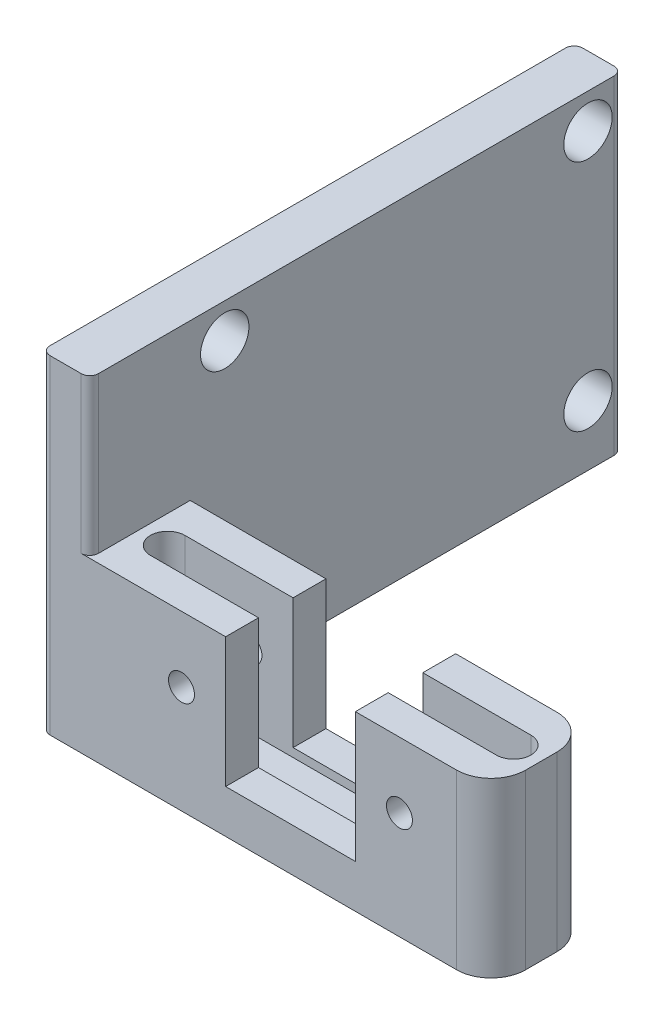
ISO-10303-21;
HEADER;
FILE_DESCRIPTION(('STEP AP214'),'2;1');
FILE_NAME('part.step','',(''),(''),'','','');
FILE_SCHEMA(('AUTOMOTIVE_DESIGN { 1 0 10303 214 1 1 1 1 }'));
ENDSEC;
DATA;
#1=APPLICATION_CONTEXT('core data for automotive mechanical design processes');
#2=APPLICATION_PROTOCOL_DEFINITION('international standard','automotive_design',2000,#1);
#3=PRODUCT_CONTEXT('',#1,'mechanical');
#4=PRODUCT('Part','Part','',(#3));
#5=PRODUCT_RELATED_PRODUCT_CATEGORY('part','',(#4));
#6=PRODUCT_DEFINITION_FORMATION('','',#4);
#7=PRODUCT_DEFINITION_CONTEXT('part definition',#1,'design');
#8=PRODUCT_DEFINITION('design','',#6,#7);
#9=PRODUCT_DEFINITION_SHAPE('','',#8);
#10=(LENGTH_UNIT() NAMED_UNIT(*) SI_UNIT(.MILLI.,.METRE.));
#11=(NAMED_UNIT(*) PLANE_ANGLE_UNIT() SI_UNIT($,.RADIAN.));
#12=(NAMED_UNIT(*) SI_UNIT($,.STERADIAN.) SOLID_ANGLE_UNIT());
#13=UNCERTAINTY_MEASURE_WITH_UNIT(LENGTH_MEASURE(1.E-05),#10,'distance_accuracy_value','');
#14=(GEOMETRIC_REPRESENTATION_CONTEXT(3) GLOBAL_UNCERTAINTY_ASSIGNED_CONTEXT((#13)) GLOBAL_UNIT_ASSIGNED_CONTEXT((#10,
#11,#12)) REPRESENTATION_CONTEXT('',''));
#15=CARTESIAN_POINT('',(0.,0.,0.));
#16=DIRECTION('',(0.,0.,1.));
#17=DIRECTION('',(1.,0.,0.));
#18=AXIS2_PLACEMENT_3D('',#15,#16,#17);
#19=CARTESIAN_POINT('',(20.78,10.,-18.4025));
#20=DIRECTION('',(0.,-1.,0.));
#21=DIRECTION('',(1.,0.,0.));
#22=AXIS2_PLACEMENT_3D('',#19,#20,#21);
#23=PLANE('',#22);
#24=DIRECTION('',(1.,0.,0.));
#25=VECTOR('',#24,1.);
#26=CARTESIAN_POINT('',(20.78,10.,12.3975));
#27=LINE('',#26,#25);
#28=CARTESIAN_POINT('',(-2.92,9.99999999999999,12.3975));
#29=VERTEX_POINT('',#28);
#30=CARTESIAN_POINT('',(5.42999999999999,9.99999999999999,12.3975));
#31=VERTEX_POINT('',#30);
#32=EDGE_CURVE('E48',#29,#31,#27,.T.);
#33=ORIENTED_EDGE('',*,*,#32,.T.);
#34=DIRECTION('',(0.,0.,1.));
#35=VECTOR('',#34,1.);
#36=CARTESIAN_POINT('',(5.42999999999999,9.99999999999999,-18.4025));
#37=LINE('',#36,#35);
#38=CARTESIAN_POINT('',(5.42999999999999,9.99999999999999,10.4975));
#39=VERTEX_POINT('',#38);
#40=EDGE_CURVE('E216',#39,#31,#37,.T.);
#41=ORIENTED_EDGE('',*,*,#40,.F.);
#42=DIRECTION('',(1.,0.,0.));
#43=VECTOR('',#42,1.);
#44=CARTESIAN_POINT('',(-0.820000000000008,9.99999999999999,10.4975));
#45=LINE('',#44,#43);
#46=CARTESIAN_POINT('',(-0.820000000000008,9.99999999999999,10.4975));
#47=VERTEX_POINT('',#46);
#48=EDGE_CURVE('E269',#47,#39,#45,.T.);
#49=ORIENTED_EDGE('',*,*,#48,.F.);
#50=CARTESIAN_POINT('',(-0.820000000000008,9.99999999999999,9.49749999999998));
#51=DIRECTION('',(0.,1.,0.));
#52=DIRECTION('',(-1.,0.,0.));
#53=AXIS2_PLACEMENT_3D('',#50,#51,#52);
#54=CIRCLE('',#53,1.);
#55=CARTESIAN_POINT('',(-0.820000000000008,9.99999999999999,8.49749999999998));
#56=VERTEX_POINT('',#55);
#57=EDGE_CURVE('E252',#56,#47,#54,.T.);
#58=ORIENTED_EDGE('',*,*,#57,.F.);
#59=DIRECTION('',(-1.,0.,0.));
#60=VECTOR('',#59,1.);
#61=CARTESIAN_POINT('',(-0.820000000000008,9.99999999999999,8.49749999999998));
#62=LINE('',#61,#60);
#63=CARTESIAN_POINT('',(5.42999999999999,9.99999999999999,8.49749999999997));
#64=VERTEX_POINT('',#63);
#65=EDGE_CURVE('E275',#64,#56,#62,.T.);
#66=ORIENTED_EDGE('',*,*,#65,.F.);
#67=CARTESIAN_POINT('',(5.42999999999999,9.99999999999999,6.59749999999998));
#68=VERTEX_POINT('',#67);
#69=EDGE_CURVE('E226',#68,#64,#37,.T.);
#70=ORIENTED_EDGE('',*,*,#69,.F.);
#71=DIRECTION('',(1.,0.,0.));
#72=VECTOR('',#71,1.);
#73=CARTESIAN_POINT('',(-2.42,9.99999999999999,6.59749999999999));
#74=LINE('',#73,#72);
#75=CARTESIAN_POINT('',(-2.42000000000001,9.99999999999999,6.59749999999998));
#76=VERTEX_POINT('',#75);
#77=EDGE_CURVE('E297',#76,#68,#74,.T.);
#78=ORIENTED_EDGE('',*,*,#77,.F.);
#79=DIRECTION('',(0.,0.,1.));
#80=VECTOR('',#79,1.);
#81=CARTESIAN_POINT('',(-2.42000000000001,9.99999999999999,-18.4025));
#82=LINE('',#81,#80);
#83=CARTESIAN_POINT('',(-2.42000000000001,9.99999999999999,11.8975));
#84=VERTEX_POINT('',#83);
#85=EDGE_CURVE('E290',#76,#84,#82,.T.);
#86=ORIENTED_EDGE('',*,*,#85,.T.);
#87=CARTESIAN_POINT('',(-2.92,9.99999999999999,11.8975));
#88=DIRECTION('',(0.,-1.,0.));
#89=DIRECTION('',(1.,0.,0.));
#90=AXIS2_PLACEMENT_3D('',#87,#88,#89);
#91=CIRCLE('',#90,0.5);
#92=EDGE_CURVE('E11',#84,#29,#91,.T.);
#93=ORIENTED_EDGE('',*,*,#92,.T.);
#94=EDGE_LOOP('',(#33,#41,#49,#58,#66,#70,#78,#86,#93));
#95=FACE_BOUND('',#94,.T.);
#96=ADVANCED_FACE('F33',(#95),#23,.F.);
#97=CARTESIAN_POINT('',(-5.22000000000001,19.,12.3975));
#98=DIRECTION('',(1.,0.,0.));
#99=DIRECTION('',(0.,0.,-1.));
#100=AXIS2_PLACEMENT_3D('',#97,#98,#99);
#101=PLANE('',#100);
#102=CARTESIAN_POINT('',(-5.22000000000001,3.5,4.59749999999999));
#103=DIRECTION('',(-1.,0.,0.));
#104=DIRECTION('',(0.,0.,1.));
#105=AXIS2_PLACEMENT_3D('',#102,#103,#104);
#106=CIRCLE('',#105,1.4);
#107=CARTESIAN_POINT('',(-5.22000000000001,3.5,5.99749999999999));
#108=VERTEX_POINT('',#107);
#109=EDGE_CURVE('E351',#108,#108,#106,.T.);
#110=ORIENTED_EDGE('',*,*,#109,.F.);
#111=EDGE_LOOP('',(#110));
#112=FACE_BOUND('',#111,.T.);
#113=CARTESIAN_POINT('',(-5.22000000000001,3.5,-16.4025));
#114=DIRECTION('',(-1.,0.,0.));
#115=DIRECTION('',(0.,0.,1.));
#116=AXIS2_PLACEMENT_3D('',#113,#114,#115);
#117=CIRCLE('',#116,1.4);
#118=CARTESIAN_POINT('',(-5.22000000000001,3.5,-15.0025));
#119=VERTEX_POINT('',#118);
#120=EDGE_CURVE('E347',#119,#119,#117,.T.);
#121=ORIENTED_EDGE('',*,*,#120,.F.);
#122=EDGE_LOOP('',(#121));
#123=FACE_BOUND('',#122,.T.);
#124=CARTESIAN_POINT('',(-5.22000000000001,17.,4.59749999999999));
#125=DIRECTION('',(-1.,0.,0.));
#126=DIRECTION('',(0.,0.,1.));
#127=AXIS2_PLACEMENT_3D('',#124,#125,#126);
#128=CIRCLE('',#127,1.4);
#129=CARTESIAN_POINT('',(-5.22000000000001,17.,5.99749999999999));
#130=VERTEX_POINT('',#129);
#131=EDGE_CURVE('E343',#130,#130,#128,.T.);
#132=ORIENTED_EDGE('',*,*,#131,.F.);
#133=EDGE_LOOP('',(#132));
#134=FACE_BOUND('',#133,.T.);
#135=CARTESIAN_POINT('',(-5.22000000000001,17.,-16.4025));
#136=DIRECTION('',(-1.,0.,0.));
#137=DIRECTION('',(0.,0.,1.));
#138=AXIS2_PLACEMENT_3D('',#135,#136,#137);
#139=CIRCLE('',#138,1.4);
#140=CARTESIAN_POINT('',(-5.22000000000001,17.,-15.0025));
#141=VERTEX_POINT('',#140);
#142=EDGE_CURVE('E339',#141,#141,#139,.T.);
#143=ORIENTED_EDGE('',*,*,#142,.F.);
#144=EDGE_LOOP('',(#143));
#145=FACE_BOUND('',#144,.T.);
#146=DIRECTION('',(0.,0.,1.));
#147=VECTOR('',#146,1.);
#148=CARTESIAN_POINT('',(-5.22000000000001,19.,12.3975));
#149=LINE('',#148,#147);
#150=CARTESIAN_POINT('',(-5.22000000000001,19.,-17.9025));
#151=VERTEX_POINT('',#150);
#152=CARTESIAN_POINT('',(-5.22000000000001,19.,11.8975));
#153=VERTEX_POINT('',#152);
#154=EDGE_CURVE('E301',#151,#153,#149,.T.);
#155=ORIENTED_EDGE('',*,*,#154,.F.);
#156=DIRECTION('',(0.,-1.,0.));
#157=VECTOR('',#156,1.);
#158=CARTESIAN_POINT('',(-5.22000000000001,19.,-17.9025));
#159=LINE('',#158,#157);
#160=CARTESIAN_POINT('',(-5.22000000000001,0.,-17.9025));
#161=VERTEX_POINT('',#160);
#162=EDGE_CURVE('E383',#151,#161,#159,.T.);
#163=ORIENTED_EDGE('',*,*,#162,.T.);
#164=DIRECTION('',(0.,0.,1.));
#165=VECTOR('',#164,1.);
#166=CARTESIAN_POINT('',(-5.22000000000001,0.,12.3975));
#167=LINE('',#166,#165);
#168=CARTESIAN_POINT('',(-5.22000000000001,0.,11.8975));
#169=VERTEX_POINT('',#168);
#170=EDGE_CURVE('E300',#161,#169,#167,.T.);
#171=ORIENTED_EDGE('',*,*,#170,.T.);
#172=DIRECTION('',(0.,-1.,0.));
#173=VECTOR('',#172,1.);
#174=CARTESIAN_POINT('',(-5.22000000000001,19.,11.8975));
#175=LINE('',#174,#173);
#176=EDGE_CURVE('E381',#169,#153,#175,.F.);
#177=ORIENTED_EDGE('',*,*,#176,.T.);
#178=EDGE_LOOP('',(#155,#163,#171,#177));
#179=FACE_BOUND('',#178,.T.);
#180=ADVANCED_FACE('F448',(#112,#123,#134,#145,#179),#101,.F.);
#181=CARTESIAN_POINT('',(20.78,19.,12.3975));
#182=DIRECTION('',(0.,0.,-1.));
#183=DIRECTION('',(-1.,0.,0.));
#184=AXIS2_PLACEMENT_3D('',#181,#182,#183);
#185=PLANE('',#184);
#186=CARTESIAN_POINT('',(15.48,6.2,12.3975));
#187=DIRECTION('',(0.,0.,1.));
#188=DIRECTION('',(1.,0.,0.));
#189=AXIS2_PLACEMENT_3D('',#186,#187,#188);
#190=CIRCLE('',#189,0.750000000000002);
#191=CARTESIAN_POINT('',(16.23,6.2,12.3975));
#192=VERTEX_POINT('',#191);
#193=EDGE_CURVE('E361',#192,#192,#190,.T.);
#194=ORIENTED_EDGE('',*,*,#193,.F.);
#195=EDGE_LOOP('',(#194));
#196=FACE_BOUND('',#195,.T.);
#197=CARTESIAN_POINT('',(2.87999999999999,6.2,12.3975));
#198=DIRECTION('',(0.,0.,1.));
#199=DIRECTION('',(1.,0.,0.));
#200=AXIS2_PLACEMENT_3D('',#197,#198,#199);
#201=CIRCLE('',#200,0.75);
#202=CARTESIAN_POINT('',(3.62999999999999,6.2,12.3975));
#203=VERTEX_POINT('',#202);
#204=EDGE_CURVE('E356',#203,#203,#201,.T.);
#205=ORIENTED_EDGE('',*,*,#204,.F.);
#206=EDGE_LOOP('',(#205));
#207=FACE_BOUND('',#206,.T.);
#208=ORIENTED_EDGE('',*,*,#32,.F.);
#209=DIRECTION('',(0.,-1.,0.));
#210=VECTOR('',#209,1.);
#211=CARTESIAN_POINT('',(-2.92,19.,12.3975));
#212=LINE('',#211,#210);
#213=CARTESIAN_POINT('',(-2.92,19.,12.3975));
#214=VERTEX_POINT('',#213);
#215=EDGE_CURVE('E52',#29,#214,#212,.F.);
#216=ORIENTED_EDGE('',*,*,#215,.T.);
#217=DIRECTION('',(1.,0.,0.));
#218=VECTOR('',#217,1.);
#219=CARTESIAN_POINT('',(20.78,19.,12.3975));
#220=LINE('',#219,#218);
#221=CARTESIAN_POINT('',(-4.72,19.,12.3975));
#222=VERTEX_POINT('',#221);
#223=EDGE_CURVE('E304',#222,#214,#220,.T.);
#224=ORIENTED_EDGE('',*,*,#223,.F.);
#225=DIRECTION('',(0.,-1.,0.));
#226=VECTOR('',#225,1.);
#227=CARTESIAN_POINT('',(-4.72000000000001,19.,12.3975));
#228=LINE('',#227,#226);
#229=CARTESIAN_POINT('',(-4.72,0.,12.3975));
#230=VERTEX_POINT('',#229);
#231=EDGE_CURVE('E386',#222,#230,#228,.T.);
#232=ORIENTED_EDGE('',*,*,#231,.T.);
#233=DIRECTION('',(1.,0.,0.));
#234=VECTOR('',#233,1.);
#235=CARTESIAN_POINT('',(20.78,0.,12.3975));
#236=LINE('',#235,#234);
#237=CARTESIAN_POINT('',(18.78,0.,12.3975));
#238=VERTEX_POINT('',#237);
#239=EDGE_CURVE('E315',#230,#238,#236,.T.);
#240=ORIENTED_EDGE('',*,*,#239,.T.);
#241=DIRECTION('',(0.,-1.,0.));
#242=VECTOR('',#241,1.);
#243=CARTESIAN_POINT('',(18.78,19.,12.3975));
#244=LINE('',#243,#242);
#245=CARTESIAN_POINT('',(18.78,10.,12.3975));
#246=VERTEX_POINT('',#245);
#247=EDGE_CURVE('E398',#238,#246,#244,.F.);
#248=ORIENTED_EDGE('',*,*,#247,.T.);
#249=CARTESIAN_POINT('',(12.93,9.99999999999999,12.3975));
#250=VERTEX_POINT('',#249);
#251=EDGE_CURVE('E281',#250,#246,#27,.T.);
#252=ORIENTED_EDGE('',*,*,#251,.F.);
#253=DIRECTION('',(0.,1.,0.));
#254=VECTOR('',#253,1.);
#255=CARTESIAN_POINT('',(12.93,2.5,12.3975));
#256=LINE('',#255,#254);
#257=CARTESIAN_POINT('',(12.93,2.5,12.3975));
#258=VERTEX_POINT('',#257);
#259=EDGE_CURVE('E211',#258,#250,#256,.T.);
#260=ORIENTED_EDGE('',*,*,#259,.F.);
#261=DIRECTION('',(1.,0.,0.));
#262=VECTOR('',#261,1.);
#263=CARTESIAN_POINT('',(12.93,2.5,12.3975));
#264=LINE('',#263,#262);
#265=CARTESIAN_POINT('',(5.42999999999999,2.5,12.3975));
#266=VERTEX_POINT('',#265);
#267=EDGE_CURVE('E204',#266,#258,#264,.T.);
#268=ORIENTED_EDGE('',*,*,#267,.F.);
#269=DIRECTION('',(0.,-1.,0.));
#270=VECTOR('',#269,1.);
#271=CARTESIAN_POINT('',(5.42999999999999,2.5,12.3975));
#272=LINE('',#271,#270);
#273=EDGE_CURVE('E213',#31,#266,#272,.T.);
#274=ORIENTED_EDGE('',*,*,#273,.F.);
#275=EDGE_LOOP('',(#208,#216,#224,#232,#240,#248,#252,#260,#268,#274));
#276=FACE_BOUND('',#275,.T.);
#277=ADVANCED_FACE('F219',(#196,#207,#276),#185,.F.);
#278=CARTESIAN_POINT('',(20.78,19.,6.59749999999999));
#279=DIRECTION('',(-1.,0.,0.));
#280=DIRECTION('',(0.,0.,1.));
#281=AXIS2_PLACEMENT_3D('',#278,#279,#280);
#282=PLANE('',#281);
#283=DIRECTION('',(0.,0.,1.));
#284=VECTOR('',#283,1.);
#285=CARTESIAN_POINT('',(20.78,10.,-18.4025));
#286=LINE('',#285,#284);
#287=CARTESIAN_POINT('',(20.78,10.,8.59749999999998));
#288=VERTEX_POINT('',#287);
#289=CARTESIAN_POINT('',(20.78,10.,10.3975));
#290=VERTEX_POINT('',#289);
#291=EDGE_CURVE('E291',#288,#290,#286,.T.);
#292=ORIENTED_EDGE('',*,*,#291,.T.);
#293=DIRECTION('',(0.,-1.,0.));
#294=VECTOR('',#293,1.);
#295=CARTESIAN_POINT('',(20.78,19.,10.3975));
#296=LINE('',#295,#294);
#297=CARTESIAN_POINT('',(20.78,0.,10.3975));
#298=VERTEX_POINT('',#297);
#299=EDGE_CURVE('E391',#290,#298,#296,.T.);
#300=ORIENTED_EDGE('',*,*,#299,.T.);
#301=DIRECTION('',(0.,0.,-1.));
#302=VECTOR('',#301,1.);
#303=CARTESIAN_POINT('',(20.78,0.,6.59749999999999));
#304=LINE('',#303,#302);
#305=CARTESIAN_POINT('',(20.78,0.,8.59749999999999));
#306=VERTEX_POINT('',#305);
#307=EDGE_CURVE('E318',#298,#306,#304,.T.);
#308=ORIENTED_EDGE('',*,*,#307,.T.);
#309=DIRECTION('',(0.,-1.,0.));
#310=VECTOR('',#309,1.);
#311=CARTESIAN_POINT('',(20.78,19.,8.59749999999999));
#312=LINE('',#311,#310);
#313=EDGE_CURVE('E389',#306,#288,#312,.F.);
#314=ORIENTED_EDGE('',*,*,#313,.T.);
#315=EDGE_LOOP('',(#292,#300,#308,#314));
#316=FACE_BOUND('',#315,.T.);
#317=ADVANCED_FACE('F461',(#316),#282,.F.);
#318=CARTESIAN_POINT('',(-2.42,19.,6.59749999999999));
#319=DIRECTION('',(0.,0.,1.));
#320=DIRECTION('',(1.,0.,0.));
#321=AXIS2_PLACEMENT_3D('',#318,#319,#320);
#322=PLANE('',#321);
#323=CARTESIAN_POINT('',(15.48,6.2,6.59749999999999));
#324=DIRECTION('',(0.,0.,1.));
#325=DIRECTION('',(1.,0.,0.));
#326=AXIS2_PLACEMENT_3D('',#323,#324,#325);
#327=CIRCLE('',#326,0.750000000000002);
#328=CARTESIAN_POINT('',(16.23,6.2,6.59749999999999));
#329=VERTEX_POINT('',#328);
#330=EDGE_CURVE('E793',#329,#329,#327,.T.);
#331=ORIENTED_EDGE('',*,*,#330,.T.);
#332=EDGE_LOOP('',(#331));
#333=FACE_BOUND('',#332,.T.);
#334=CARTESIAN_POINT('',(2.87999999999999,6.2,6.59749999999999));
#335=DIRECTION('',(0.,0.,1.));
#336=DIRECTION('',(1.,0.,0.));
#337=AXIS2_PLACEMENT_3D('',#334,#335,#336);
#338=CIRCLE('',#337,0.75);
#339=CARTESIAN_POINT('',(3.62999999999999,6.2,6.59749999999999));
#340=VERTEX_POINT('',#339);
#341=EDGE_CURVE('E761',#340,#340,#338,.T.);
#342=ORIENTED_EDGE('',*,*,#341,.T.);
#343=EDGE_LOOP('',(#342));
#344=FACE_BOUND('',#343,.T.);
#345=CARTESIAN_POINT('',(12.93,9.99999999999999,6.59749999999998));
#346=VERTEX_POINT('',#345);
#347=CARTESIAN_POINT('',(18.78,10.,6.59749999999999));
#348=VERTEX_POINT('',#347);
#349=EDGE_CURVE('E294',#346,#348,#74,.T.);
#350=ORIENTED_EDGE('',*,*,#349,.T.);
#351=DIRECTION('',(0.,-1.,0.));
#352=VECTOR('',#351,1.);
#353=CARTESIAN_POINT('',(18.78,19.,6.59749999999999));
#354=LINE('',#353,#352);
#355=CARTESIAN_POINT('',(18.78,0.,6.59749999999999));
#356=VERTEX_POINT('',#355);
#357=EDGE_CURVE('E404',#348,#356,#354,.T.);
#358=ORIENTED_EDGE('',*,*,#357,.T.);
#359=DIRECTION('',(-1.,0.,0.));
#360=VECTOR('',#359,1.);
#361=CARTESIAN_POINT('',(-2.42,0.,6.59749999999999));
#362=LINE('',#361,#360);
#363=CARTESIAN_POINT('',(-2.42,0.,6.59749999999999));
#364=VERTEX_POINT('',#363);
#365=EDGE_CURVE('E321',#356,#364,#362,.T.);
#366=ORIENTED_EDGE('',*,*,#365,.T.);
#367=DIRECTION('',(0.,-1.,0.));
#368=VECTOR('',#367,1.);
#369=CARTESIAN_POINT('',(-2.42,19.,6.59749999999999));
#370=LINE('',#369,#368);
#371=EDGE_CURVE('E312',#76,#364,#370,.T.);
#372=ORIENTED_EDGE('',*,*,#371,.F.);
#373=ORIENTED_EDGE('',*,*,#77,.T.);
#374=DIRECTION('',(0.,-1.,0.));
#375=VECTOR('',#374,1.);
#376=CARTESIAN_POINT('',(5.42999999999999,19.,6.59749999999999));
#377=LINE('',#376,#375);
#378=CARTESIAN_POINT('',(5.42999999999999,2.5,6.59749999999999));
#379=VERTEX_POINT('',#378);
#380=EDGE_CURVE('E249',#68,#379,#377,.T.);
#381=ORIENTED_EDGE('',*,*,#380,.T.);
#382=DIRECTION('',(1.,0.,0.));
#383=VECTOR('',#382,1.);
#384=CARTESIAN_POINT('',(-2.42,2.49999999999999,6.59749999999999));
#385=LINE('',#384,#383);
#386=CARTESIAN_POINT('',(12.93,2.5,6.59749999999999));
#387=VERTEX_POINT('',#386);
#388=EDGE_CURVE('E237',#379,#387,#385,.T.);
#389=ORIENTED_EDGE('',*,*,#388,.T.);
#390=DIRECTION('',(0.,1.,0.));
#391=VECTOR('',#390,1.);
#392=CARTESIAN_POINT('',(12.93,19.,6.59749999999999));
#393=LINE('',#392,#391);
#394=EDGE_CURVE('E243',#387,#346,#393,.T.);
#395=ORIENTED_EDGE('',*,*,#394,.T.);
#396=EDGE_LOOP('',(#350,#358,#366,#372,#373,#381,#389,#395));
#397=FACE_BOUND('',#396,.T.);
#398=ADVANCED_FACE('F427',(#333,#344,#397),#322,.F.);
#399=CARTESIAN_POINT('',(-2.42000000000001,19.,-18.4025));
#400=DIRECTION('',(-1.,0.,0.));
#401=DIRECTION('',(0.,0.,1.));
#402=AXIS2_PLACEMENT_3D('',#399,#400,#401);
#403=PLANE('',#402);
#404=CARTESIAN_POINT('',(-2.42,3.5,4.59749999999999));
#405=DIRECTION('',(-1.,0.,0.));
#406=DIRECTION('',(0.,0.,1.));
#407=AXIS2_PLACEMENT_3D('',#404,#405,#406);
#408=CIRCLE('',#407,1.4);
#409=CARTESIAN_POINT('',(-2.42,3.5,5.99749999999999));
#410=VERTEX_POINT('',#409);
#411=EDGE_CURVE('E348',#410,#410,#408,.T.);
#412=ORIENTED_EDGE('',*,*,#411,.T.);
#413=EDGE_LOOP('',(#412));
#414=FACE_BOUND('',#413,.T.);
#415=CARTESIAN_POINT('',(-2.42000000000001,3.5,-16.4025));
#416=DIRECTION('',(-1.,0.,0.));
#417=DIRECTION('',(0.,0.,1.));
#418=AXIS2_PLACEMENT_3D('',#415,#416,#417);
#419=CIRCLE('',#418,1.4);
#420=CARTESIAN_POINT('',(-2.42000000000001,3.5,-15.0025));
#421=VERTEX_POINT('',#420);
#422=EDGE_CURVE('E344',#421,#421,#419,.T.);
#423=ORIENTED_EDGE('',*,*,#422,.T.);
#424=EDGE_LOOP('',(#423));
#425=FACE_BOUND('',#424,.T.);
#426=CARTESIAN_POINT('',(-2.42,17.,4.59749999999999));
#427=DIRECTION('',(-1.,0.,0.));
#428=DIRECTION('',(0.,0.,1.));
#429=AXIS2_PLACEMENT_3D('',#426,#427,#428);
#430=CIRCLE('',#429,1.4);
#431=CARTESIAN_POINT('',(-2.42,17.,5.99749999999999));
#432=VERTEX_POINT('',#431);
#433=EDGE_CURVE('E340',#432,#432,#430,.T.);
#434=ORIENTED_EDGE('',*,*,#433,.T.);
#435=EDGE_LOOP('',(#434));
#436=FACE_BOUND('',#435,.T.);
#437=CARTESIAN_POINT('',(-2.42000000000001,17.,-16.4025));
#438=DIRECTION('',(-1.,0.,0.));
#439=DIRECTION('',(0.,0.,1.));
#440=AXIS2_PLACEMENT_3D('',#437,#438,#439);
#441=CIRCLE('',#440,1.4);
#442=CARTESIAN_POINT('',(-2.42000000000001,17.,-15.0025));
#443=VERTEX_POINT('',#442);
#444=EDGE_CURVE('E217',#443,#443,#441,.T.);
#445=ORIENTED_EDGE('',*,*,#444,.T.);
#446=EDGE_LOOP('',(#445));
#447=FACE_BOUND('',#446,.T.);
#448=DIRECTION('',(0.,0.,-1.));
#449=VECTOR('',#448,1.);
#450=CARTESIAN_POINT('',(-2.42000000000001,19.,-18.4025));
#451=LINE('',#450,#449);
#452=CARTESIAN_POINT('',(-2.42,19.,11.8975));
#453=VERTEX_POINT('',#452);
#454=CARTESIAN_POINT('',(-2.42000000000001,19.,-17.9025));
#455=VERTEX_POINT('',#454);
#456=EDGE_CURVE('E307',#453,#455,#451,.T.);
#457=ORIENTED_EDGE('',*,*,#456,.F.);
#458=DIRECTION('',(0.,-1.,0.));
#459=VECTOR('',#458,1.);
#460=CARTESIAN_POINT('',(-2.42,19.,11.8975));
#461=LINE('',#460,#459);
#462=EDGE_CURVE('E407',#453,#84,#461,.T.);
#463=ORIENTED_EDGE('',*,*,#462,.T.);
#464=ORIENTED_EDGE('',*,*,#85,.F.);
#465=ORIENTED_EDGE('',*,*,#371,.T.);
#466=DIRECTION('',(0.,0.,-1.));
#467=VECTOR('',#466,1.);
#468=CARTESIAN_POINT('',(-2.42000000000001,0.,-18.4025));
#469=LINE('',#468,#467);
#470=CARTESIAN_POINT('',(-2.42000000000001,0.,-17.9025));
#471=VERTEX_POINT('',#470);
#472=EDGE_CURVE('E323',#364,#471,#469,.T.);
#473=ORIENTED_EDGE('',*,*,#472,.T.);
#474=DIRECTION('',(0.,-1.,0.));
#475=VECTOR('',#474,1.);
#476=CARTESIAN_POINT('',(-2.42000000000001,19.,-17.9025));
#477=LINE('',#476,#475);
#478=EDGE_CURVE('E372',#471,#455,#477,.F.);
#479=ORIENTED_EDGE('',*,*,#478,.T.);
#480=EDGE_LOOP('',(#457,#463,#464,#465,#473,#479));
#481=FACE_BOUND('',#480,.T.);
#482=ADVANCED_FACE('F417',(#414,#425,#436,#447,#481),#403,.F.);
#483=CARTESIAN_POINT('',(-5.22000000000001,19.,-18.4025));
#484=DIRECTION('',(0.,0.,1.));
#485=DIRECTION('',(1.,0.,0.));
#486=AXIS2_PLACEMENT_3D('',#483,#484,#485);
#487=PLANE('',#486);
#488=DIRECTION('',(-1.,0.,0.));
#489=VECTOR('',#488,1.);
#490=CARTESIAN_POINT('',(-5.22000000000001,19.,-18.4025));
#491=LINE('',#490,#489);
#492=CARTESIAN_POINT('',(-2.92000000000001,19.,-18.4025));
#493=VERTEX_POINT('',#492);
#494=CARTESIAN_POINT('',(-4.72000000000001,19.,-18.4025));
#495=VERTEX_POINT('',#494);
#496=EDGE_CURVE('E309',#493,#495,#491,.T.);
#497=ORIENTED_EDGE('',*,*,#496,.F.);
#498=DIRECTION('',(0.,-1.,0.));
#499=VECTOR('',#498,1.);
#500=CARTESIAN_POINT('',(-2.92000000000001,19.,-18.4025));
#501=LINE('',#500,#499);
#502=CARTESIAN_POINT('',(-2.92000000000001,0.,-18.4025));
#503=VERTEX_POINT('',#502);
#504=EDGE_CURVE('E363',#493,#503,#501,.T.);
#505=ORIENTED_EDGE('',*,*,#504,.T.);
#506=DIRECTION('',(-1.,0.,0.));
#507=VECTOR('',#506,1.);
#508=CARTESIAN_POINT('',(-5.22000000000001,0.,-18.4025));
#509=LINE('',#508,#507);
#510=CARTESIAN_POINT('',(-4.72000000000001,0.,-18.4025));
#511=VERTEX_POINT('',#510);
#512=EDGE_CURVE('E305',#503,#511,#509,.T.);
#513=ORIENTED_EDGE('',*,*,#512,.T.);
#514=DIRECTION('',(0.,-1.,0.));
#515=VECTOR('',#514,1.);
#516=CARTESIAN_POINT('',(-4.72000000000001,19.,-18.4025));
#517=LINE('',#516,#515);
#518=EDGE_CURVE('E336',#511,#495,#517,.F.);
#519=ORIENTED_EDGE('',*,*,#518,.T.);
#520=EDGE_LOOP('',(#497,#505,#513,#519));
#521=FACE_BOUND('',#520,.T.);
#522=ADVANCED_FACE('F440',(#521),#487,.F.);
#523=CARTESIAN_POINT('',(0.,19.,0.));
#524=DIRECTION('',(0.,-1.,0.));
#525=DIRECTION('',(0.,0.,-1.));
#526=AXIS2_PLACEMENT_3D('',#523,#524,#525);
#527=PLANE('',#526);
#528=ORIENTED_EDGE('',*,*,#223,.T.);
#529=CARTESIAN_POINT('',(-2.92,19.,11.8975));
#530=DIRECTION('',(0.,-1.,0.));
#531=DIRECTION('',(0.,0.,-1.));
#532=AXIS2_PLACEMENT_3D('',#529,#530,#531);
#533=CIRCLE('',#532,0.5);
#534=EDGE_CURVE('E41',#214,#453,#533,.F.);
#535=ORIENTED_EDGE('',*,*,#534,.T.);
#536=ORIENTED_EDGE('',*,*,#456,.T.);
#537=CARTESIAN_POINT('',(-2.92000000000001,19.,-17.9025));
#538=DIRECTION('',(0.,-1.,0.));
#539=DIRECTION('',(0.,0.,-1.));
#540=AXIS2_PLACEMENT_3D('',#537,#538,#539);
#541=CIRCLE('',#540,0.5);
#542=EDGE_CURVE('E379',#455,#493,#541,.F.);
#543=ORIENTED_EDGE('',*,*,#542,.T.);
#544=ORIENTED_EDGE('',*,*,#496,.T.);
#545=CARTESIAN_POINT('',(-4.72000000000001,19.,-17.9025));
#546=DIRECTION('',(0.,-1.,0.));
#547=DIRECTION('',(0.,0.,-1.));
#548=AXIS2_PLACEMENT_3D('',#545,#546,#547);
#549=CIRCLE('',#548,0.5);
#550=EDGE_CURVE('E377',#495,#151,#549,.F.);
#551=ORIENTED_EDGE('',*,*,#550,.T.);
#552=ORIENTED_EDGE('',*,*,#154,.T.);
#553=CARTESIAN_POINT('',(-4.72000000000001,19.,11.8975));
#554=DIRECTION('',(0.,-1.,0.));
#555=DIRECTION('',(0.,0.,-1.));
#556=AXIS2_PLACEMENT_3D('',#553,#554,#555);
#557=CIRCLE('',#556,0.5);
#558=EDGE_CURVE('E375',#153,#222,#557,.F.);
#559=ORIENTED_EDGE('',*,*,#558,.T.);
#560=EDGE_LOOP('',(#528,#535,#536,#543,#544,#551,#552,#559));
#561=FACE_BOUND('',#560,.T.);
#562=ADVANCED_FACE('F413',(#561),#527,.F.);
#563=CARTESIAN_POINT('',(0.,0.,0.));
#564=DIRECTION('',(0.,-1.,0.));
#565=DIRECTION('',(0.,0.,-1.));
#566=AXIS2_PLACEMENT_3D('',#563,#564,#565);
#567=PLANE('',#566);
#568=ORIENTED_EDGE('',*,*,#307,.F.);
#569=CARTESIAN_POINT('',(18.78,0.,10.3975));
#570=DIRECTION('',(0.,-1.,0.));
#571=DIRECTION('',(0.,0.,-1.));
#572=AXIS2_PLACEMENT_3D('',#569,#570,#571);
#573=CIRCLE('',#572,2.);
#574=EDGE_CURVE('E396',#298,#238,#573,.T.);
#575=ORIENTED_EDGE('',*,*,#574,.T.);
#576=ORIENTED_EDGE('',*,*,#239,.F.);
#577=CARTESIAN_POINT('',(-4.72000000000001,0.,11.8975));
#578=DIRECTION('',(0.,-1.,0.));
#579=DIRECTION('',(0.,0.,-1.));
#580=AXIS2_PLACEMENT_3D('',#577,#578,#579);
#581=CIRCLE('',#580,0.5);
#582=EDGE_CURVE('E366',#230,#169,#581,.T.);
#583=ORIENTED_EDGE('',*,*,#582,.T.);
#584=ORIENTED_EDGE('',*,*,#170,.F.);
#585=CARTESIAN_POINT('',(-4.72000000000001,0.,-17.9025));
#586=DIRECTION('',(0.,-1.,0.));
#587=DIRECTION('',(0.,0.,-1.));
#588=AXIS2_PLACEMENT_3D('',#585,#586,#587);
#589=CIRCLE('',#588,0.5);
#590=EDGE_CURVE('E368',#161,#511,#589,.T.);
#591=ORIENTED_EDGE('',*,*,#590,.T.);
#592=ORIENTED_EDGE('',*,*,#512,.F.);
#593=CARTESIAN_POINT('',(-2.92000000000001,0.,-17.9025));
#594=DIRECTION('',(0.,-1.,0.));
#595=DIRECTION('',(0.,0.,-1.));
#596=AXIS2_PLACEMENT_3D('',#593,#594,#595);
#597=CIRCLE('',#596,0.5);
#598=EDGE_CURVE('E370',#503,#471,#597,.T.);
#599=ORIENTED_EDGE('',*,*,#598,.T.);
#600=ORIENTED_EDGE('',*,*,#472,.F.);
#601=ORIENTED_EDGE('',*,*,#365,.F.);
#602=CARTESIAN_POINT('',(18.78,0.,8.59749999999999));
#603=DIRECTION('',(0.,-1.,0.));
#604=DIRECTION('',(0.,0.,-1.));
#605=AXIS2_PLACEMENT_3D('',#602,#603,#604);
#606=CIRCLE('',#605,2.);
#607=EDGE_CURVE('E394',#356,#306,#606,.T.);
#608=ORIENTED_EDGE('',*,*,#607,.T.);
#609=EDGE_LOOP('',(#568,#575,#576,#583,#584,#591,#592,#599,#600,#601,#608));
#610=FACE_BOUND('',#609,.T.);
#611=ADVANCED_FACE('F432',(#610),#567,.T.);
#612=ORIENTED_EDGE('',*,*,#251,.T.);
#613=CARTESIAN_POINT('',(18.78,10.,10.3975));
#614=DIRECTION('',(0.,-1.,0.));
#615=DIRECTION('',(1.,0.,0.));
#616=AXIS2_PLACEMENT_3D('',#613,#614,#615);
#617=CIRCLE('',#616,2.);
#618=EDGE_CURVE('E402',#246,#290,#617,.F.);
#619=ORIENTED_EDGE('',*,*,#618,.T.);
#620=ORIENTED_EDGE('',*,*,#291,.F.);
#621=CARTESIAN_POINT('',(18.78,10.,8.59749999999999));
#622=DIRECTION('',(0.,-1.,0.));
#623=DIRECTION('',(1.,0.,0.));
#624=AXIS2_PLACEMENT_3D('',#621,#622,#623);
#625=CIRCLE('',#624,2.);
#626=EDGE_CURVE('E400',#288,#348,#625,.F.);
#627=ORIENTED_EDGE('',*,*,#626,.T.);
#628=ORIENTED_EDGE('',*,*,#349,.F.);
#629=DIRECTION('',(0.,0.,1.));
#630=VECTOR('',#629,1.);
#631=CARTESIAN_POINT('',(12.93,9.99999999999999,-18.4025));
#632=LINE('',#631,#630);
#633=CARTESIAN_POINT('',(12.93,9.99999999999999,8.49749999999997));
#634=VERTEX_POINT('',#633);
#635=EDGE_CURVE('E227',#346,#634,#632,.T.);
#636=ORIENTED_EDGE('',*,*,#635,.T.);
#637=CARTESIAN_POINT('',(19.18,10.,8.49749999999998));
#638=VERTEX_POINT('',#637);
#639=EDGE_CURVE('E257',#638,#634,#62,.T.);
#640=ORIENTED_EDGE('',*,*,#639,.F.);
#641=CARTESIAN_POINT('',(19.18,10.,9.49749999999998));
#642=DIRECTION('',(0.,1.,0.));
#643=DIRECTION('',(-1.,0.,0.));
#644=AXIS2_PLACEMENT_3D('',#641,#642,#643);
#645=CIRCLE('',#644,1.);
#646=CARTESIAN_POINT('',(19.18,10.,10.4975));
#647=VERTEX_POINT('',#646);
#648=EDGE_CURVE('E272',#647,#638,#645,.T.);
#649=ORIENTED_EDGE('',*,*,#648,.F.);
#650=CARTESIAN_POINT('',(12.93,9.99999999999999,10.4975));
#651=VERTEX_POINT('',#650);
#652=EDGE_CURVE('E268',#651,#647,#45,.T.);
#653=ORIENTED_EDGE('',*,*,#652,.F.);
#654=EDGE_CURVE('E228',#651,#250,#632,.T.);
#655=ORIENTED_EDGE('',*,*,#654,.T.);
#656=EDGE_LOOP('',(#612,#619,#620,#627,#628,#636,#640,#649,#653,#655));
#657=FACE_BOUND('',#656,.T.);
#658=ADVANCED_FACE('F467',(#657),#23,.F.);
#659=CARTESIAN_POINT('',(-0.820000000000007,1.99999999999999,9.49749999999998));
#660=DIRECTION('',(0.,1.,0.));
#661=DIRECTION('',(-1.,0.,0.));
#662=AXIS2_PLACEMENT_3D('',#659,#660,#661);
#663=CYLINDRICAL_SURFACE('',#662,1.);
#664=ORIENTED_EDGE('',*,*,#57,.T.);
#665=DIRECTION('',(0.,1.,0.));
#666=VECTOR('',#665,1.);
#667=CARTESIAN_POINT('',(-0.820000000000007,1.99999999999999,10.4975));
#668=LINE('',#667,#666);
#669=CARTESIAN_POINT('',(-0.820000000000007,1.99999999999999,10.4975));
#670=VERTEX_POINT('',#669);
#671=EDGE_CURVE('E266',#670,#47,#668,.T.);
#672=ORIENTED_EDGE('',*,*,#671,.F.);
#673=CARTESIAN_POINT('',(-0.820000000000007,1.99999999999999,9.49749999999998));
#674=DIRECTION('',(0.,1.,0.));
#675=DIRECTION('',(-1.,0.,0.));
#676=AXIS2_PLACEMENT_3D('',#673,#674,#675);
#677=CIRCLE('',#676,1.);
#678=CARTESIAN_POINT('',(-0.820000000000007,1.99999999999999,8.49749999999998));
#679=VERTEX_POINT('',#678);
#680=EDGE_CURVE('E253',#679,#670,#677,.T.);
#681=ORIENTED_EDGE('',*,*,#680,.F.);
#682=DIRECTION('',(0.,1.,0.));
#683=VECTOR('',#682,1.);
#684=CARTESIAN_POINT('',(-0.820000000000007,1.99999999999999,8.49749999999998));
#685=LINE('',#684,#683);
#686=EDGE_CURVE('E278',#679,#56,#685,.T.);
#687=ORIENTED_EDGE('',*,*,#686,.T.);
#688=EDGE_LOOP('',(#664,#672,#681,#687));
#689=FACE_BOUND('',#688,.T.);
#690=ADVANCED_FACE('F487',(#689),#663,.F.);
#691=CARTESIAN_POINT('',(-0.820000000000007,1.99999999999999,8.49749999999998));
#692=DIRECTION('',(0.,0.,-1.));
#693=DIRECTION('',(-1.,0.,0.));
#694=AXIS2_PLACEMENT_3D('',#691,#692,#693);
#695=PLANE('',#694);
#696=CARTESIAN_POINT('',(15.48,6.2,8.49749999999998));
#697=DIRECTION('',(0.,0.,-1.));
#698=DIRECTION('',(-1.,0.,0.));
#699=AXIS2_PLACEMENT_3D('',#696,#697,#698);
#700=CIRCLE('',#699,0.750000000000002);
#701=CARTESIAN_POINT('',(14.73,6.2,8.49749999999998));
#702=VERTEX_POINT('',#701);
#703=EDGE_CURVE('E360',#702,#702,#700,.T.);
#704=ORIENTED_EDGE('',*,*,#703,.T.);
#705=EDGE_LOOP('',(#704));
#706=FACE_BOUND('',#705,.T.);
#707=CARTESIAN_POINT('',(2.87999999999999,6.2,8.49749999999998));
#708=DIRECTION('',(0.,0.,-1.));
#709=DIRECTION('',(-1.,0.,0.));
#710=AXIS2_PLACEMENT_3D('',#707,#708,#709);
#711=CIRCLE('',#710,0.75);
#712=CARTESIAN_POINT('',(2.12999999999999,6.2,8.49749999999998));
#713=VERTEX_POINT('',#712);
#714=EDGE_CURVE('E355',#713,#713,#711,.T.);
#715=ORIENTED_EDGE('',*,*,#714,.T.);
#716=EDGE_LOOP('',(#715));
#717=FACE_BOUND('',#716,.T.);
#718=DIRECTION('',(-1.,0.,0.));
#719=VECTOR('',#718,1.);
#720=CARTESIAN_POINT('',(-0.820000000000007,2.49999999999999,8.49749999999998));
#721=LINE('',#720,#719);
#722=CARTESIAN_POINT('',(12.93,2.5,8.49749999999997));
#723=VERTEX_POINT('',#722);
#724=CARTESIAN_POINT('',(5.42999999999999,2.5,8.49749999999998));
#725=VERTEX_POINT('',#724);
#726=EDGE_CURVE('E234',#723,#725,#721,.T.);
#727=ORIENTED_EDGE('',*,*,#726,.T.);
#728=DIRECTION('',(0.,1.,0.));
#729=VECTOR('',#728,1.);
#730=CARTESIAN_POINT('',(5.42999999999999,1.99999999999999,8.49749999999998));
#731=LINE('',#730,#729);
#732=EDGE_CURVE('E246',#725,#64,#731,.T.);
#733=ORIENTED_EDGE('',*,*,#732,.T.);
#734=ORIENTED_EDGE('',*,*,#65,.T.);
#735=ORIENTED_EDGE('',*,*,#686,.F.);
#736=DIRECTION('',(-1.,0.,0.));
#737=VECTOR('',#736,1.);
#738=CARTESIAN_POINT('',(-0.820000000000007,1.99999999999999,8.49749999999998));
#739=LINE('',#738,#737);
#740=CARTESIAN_POINT('',(19.18,2.,8.49749999999998));
#741=VERTEX_POINT('',#740);
#742=EDGE_CURVE('E263',#741,#679,#739,.T.);
#743=ORIENTED_EDGE('',*,*,#742,.F.);
#744=DIRECTION('',(0.,1.,0.));
#745=VECTOR('',#744,1.);
#746=CARTESIAN_POINT('',(19.18,2.,8.49749999999998));
#747=LINE('',#746,#745);
#748=EDGE_CURVE('E282',#741,#638,#747,.T.);
#749=ORIENTED_EDGE('',*,*,#748,.T.);
#750=ORIENTED_EDGE('',*,*,#639,.T.);
#751=DIRECTION('',(0.,-1.,0.));
#752=VECTOR('',#751,1.);
#753=CARTESIAN_POINT('',(12.93,1.99999999999999,8.49749999999998));
#754=LINE('',#753,#752);
#755=EDGE_CURVE('E240',#634,#723,#754,.T.);
#756=ORIENTED_EDGE('',*,*,#755,.T.);
#757=EDGE_LOOP('',(#727,#733,#734,#735,#743,#749,#750,#756));
#758=FACE_BOUND('',#757,.T.);
#759=ADVANCED_FACE('F492',(#706,#717,#758),#695,.F.);
#760=CARTESIAN_POINT('',(19.18,2.,9.49749999999998));
#761=DIRECTION('',(0.,1.,0.));
#762=DIRECTION('',(-1.,0.,0.));
#763=AXIS2_PLACEMENT_3D('',#760,#761,#762);
#764=CYLINDRICAL_SURFACE('',#763,1.);
#765=ORIENTED_EDGE('',*,*,#648,.T.);
#766=ORIENTED_EDGE('',*,*,#748,.F.);
#767=CARTESIAN_POINT('',(19.18,2.,9.49749999999998));
#768=DIRECTION('',(0.,1.,0.));
#769=DIRECTION('',(-1.,0.,0.));
#770=AXIS2_PLACEMENT_3D('',#767,#768,#769);
#771=CIRCLE('',#770,1.);
#772=CARTESIAN_POINT('',(19.18,2.,10.4975));
#773=VERTEX_POINT('',#772);
#774=EDGE_CURVE('E260',#773,#741,#771,.T.);
#775=ORIENTED_EDGE('',*,*,#774,.F.);
#776=DIRECTION('',(0.,1.,0.));
#777=VECTOR('',#776,1.);
#778=CARTESIAN_POINT('',(19.18,2.,10.4975));
#779=LINE('',#778,#777);
#780=EDGE_CURVE('E284',#773,#647,#779,.T.);
#781=ORIENTED_EDGE('',*,*,#780,.T.);
#782=EDGE_LOOP('',(#765,#766,#775,#781));
#783=FACE_BOUND('',#782,.T.);
#784=ADVANCED_FACE('F706',(#783),#764,.F.);
#785=CARTESIAN_POINT('',(-0.820000000000007,1.99999999999999,10.4975));
#786=DIRECTION('',(0.,0.,1.));
#787=DIRECTION('',(1.,0.,0.));
#788=AXIS2_PLACEMENT_3D('',#785,#786,#787);
#789=PLANE('',#788);
#790=CARTESIAN_POINT('',(15.48,6.2,10.4975));
#791=DIRECTION('',(0.,0.,1.));
#792=DIRECTION('',(1.,0.,0.));
#793=AXIS2_PLACEMENT_3D('',#790,#791,#792);
#794=CIRCLE('',#793,0.750000000000002);
#795=CARTESIAN_POINT('',(16.23,6.2,10.4975));
#796=VERTEX_POINT('',#795);
#797=EDGE_CURVE('E357',#796,#796,#794,.T.);
#798=ORIENTED_EDGE('',*,*,#797,.T.);
#799=EDGE_LOOP('',(#798));
#800=FACE_BOUND('',#799,.T.);
#801=CARTESIAN_POINT('',(2.87999999999999,6.2,10.4975));
#802=DIRECTION('',(0.,0.,1.));
#803=DIRECTION('',(1.,0.,0.));
#804=AXIS2_PLACEMENT_3D('',#801,#802,#803);
#805=CIRCLE('',#804,0.75);
#806=CARTESIAN_POINT('',(3.62999999999999,6.2,10.4975));
#807=VERTEX_POINT('',#806);
#808=EDGE_CURVE('E352',#807,#807,#805,.T.);
#809=ORIENTED_EDGE('',*,*,#808,.T.);
#810=EDGE_LOOP('',(#809));
#811=FACE_BOUND('',#810,.T.);
#812=ORIENTED_EDGE('',*,*,#48,.T.);
#813=DIRECTION('',(0.,-1.,0.));
#814=VECTOR('',#813,1.);
#815=CARTESIAN_POINT('',(5.42999999999999,1.99999999999999,10.4975));
#816=LINE('',#815,#814);
#817=CARTESIAN_POINT('',(5.42999999999999,2.5,10.4975));
#818=VERTEX_POINT('',#817);
#819=EDGE_CURVE('E334',#39,#818,#816,.T.);
#820=ORIENTED_EDGE('',*,*,#819,.T.);
#821=DIRECTION('',(1.,0.,0.));
#822=VECTOR('',#821,1.);
#823=CARTESIAN_POINT('',(-0.820000000000007,2.49999999999999,10.4975));
#824=LINE('',#823,#822);
#825=CARTESIAN_POINT('',(12.93,2.5,10.4975));
#826=VERTEX_POINT('',#825);
#827=EDGE_CURVE('E207',#818,#826,#824,.T.);
#828=ORIENTED_EDGE('',*,*,#827,.T.);
#829=DIRECTION('',(0.,1.,0.));
#830=VECTOR('',#829,1.);
#831=CARTESIAN_POINT('',(12.93,1.99999999999999,10.4975));
#832=LINE('',#831,#830);
#833=EDGE_CURVE('E331',#826,#651,#832,.T.);
#834=ORIENTED_EDGE('',*,*,#833,.T.);
#835=ORIENTED_EDGE('',*,*,#652,.T.);
#836=ORIENTED_EDGE('',*,*,#780,.F.);
#837=DIRECTION('',(1.,0.,0.));
#838=VECTOR('',#837,1.);
#839=CARTESIAN_POINT('',(-0.820000000000007,1.99999999999999,10.4975));
#840=LINE('',#839,#838);
#841=EDGE_CURVE('E256',#670,#773,#840,.T.);
#842=ORIENTED_EDGE('',*,*,#841,.F.);
#843=ORIENTED_EDGE('',*,*,#671,.T.);
#844=EDGE_LOOP('',(#812,#820,#828,#834,#835,#836,#842,#843));
#845=FACE_BOUND('',#844,.T.);
#846=ADVANCED_FACE('F699',(#800,#811,#845),#789,.F.);
#847=CARTESIAN_POINT('',(-0.820000000000007,1.99999999999999,9.49749999999998));
#848=DIRECTION('',(0.,1.,0.));
#849=DIRECTION('',(-1.,0.,0.));
#850=AXIS2_PLACEMENT_3D('',#847,#848,#849);
#851=PLANE('',#850);
#852=ORIENTED_EDGE('',*,*,#680,.T.);
#853=ORIENTED_EDGE('',*,*,#841,.T.);
#854=ORIENTED_EDGE('',*,*,#774,.T.);
#855=ORIENTED_EDGE('',*,*,#742,.T.);
#856=EDGE_LOOP('',(#852,#853,#854,#855));
#857=FACE_BOUND('',#856,.T.);
#858=ADVANCED_FACE('F694',(#857),#851,.T.);
#859=CARTESIAN_POINT('',(12.93,2.5,-18.4025));
#860=DIRECTION('',(0.,-1.,0.));
#861=DIRECTION('',(1.,0.,0.));
#862=AXIS2_PLACEMENT_3D('',#859,#860,#861);
#863=PLANE('',#862);
#864=DIRECTION('',(0.,0.,1.));
#865=VECTOR('',#864,1.);
#866=CARTESIAN_POINT('',(5.42999999999999,2.5,-18.4025));
#867=LINE('',#866,#865);
#868=EDGE_CURVE('E200',#818,#266,#867,.T.);
#869=ORIENTED_EDGE('',*,*,#868,.T.);
#870=ORIENTED_EDGE('',*,*,#267,.T.);
#871=DIRECTION('',(0.,0.,1.));
#872=VECTOR('',#871,1.);
#873=CARTESIAN_POINT('',(12.93,2.5,-18.4025));
#874=LINE('',#873,#872);
#875=EDGE_CURVE('E232',#826,#258,#874,.T.);
#876=ORIENTED_EDGE('',*,*,#875,.F.);
#877=ORIENTED_EDGE('',*,*,#827,.F.);
#878=EDGE_LOOP('',(#869,#870,#876,#877));
#879=FACE_BOUND('',#878,.T.);
#880=ADVANCED_FACE('F202',(#879),#863,.F.);
#881=CARTESIAN_POINT('',(12.93,2.5,-18.4025));
#882=DIRECTION('',(1.,0.,0.));
#883=DIRECTION('',(0.,0.,-1.));
#884=AXIS2_PLACEMENT_3D('',#881,#882,#883);
#885=PLANE('',#884);
#886=ORIENTED_EDGE('',*,*,#875,.T.);
#887=ORIENTED_EDGE('',*,*,#259,.T.);
#888=ORIENTED_EDGE('',*,*,#654,.F.);
#889=ORIENTED_EDGE('',*,*,#833,.F.);
#890=EDGE_LOOP('',(#886,#887,#888,#889));
#891=FACE_BOUND('',#890,.T.);
#892=ADVANCED_FACE('F670',(#891),#885,.F.);
#893=CARTESIAN_POINT('',(5.42999999999999,2.5,-18.4025));
#894=DIRECTION('',(-1.,0.,0.));
#895=DIRECTION('',(0.,0.,1.));
#896=AXIS2_PLACEMENT_3D('',#893,#894,#895);
#897=PLANE('',#896);
#898=ORIENTED_EDGE('',*,*,#40,.T.);
#899=ORIENTED_EDGE('',*,*,#273,.T.);
#900=ORIENTED_EDGE('',*,*,#868,.F.);
#901=ORIENTED_EDGE('',*,*,#819,.F.);
#902=EDGE_LOOP('',(#898,#899,#900,#901));
#903=FACE_BOUND('',#902,.T.);
#904=ADVANCED_FACE('F214',(#903),#897,.F.);
#905=ORIENTED_EDGE('',*,*,#69,.T.);
#906=ORIENTED_EDGE('',*,*,#732,.F.);
#907=EDGE_CURVE('E210',#379,#725,#867,.T.);
#908=ORIENTED_EDGE('',*,*,#907,.F.);
#909=ORIENTED_EDGE('',*,*,#380,.F.);
#910=EDGE_LOOP('',(#905,#906,#908,#909));
#911=FACE_BOUND('',#910,.T.);
#912=ADVANCED_FACE('F667',(#911),#897,.F.);
#913=EDGE_CURVE('E231',#387,#723,#874,.T.);
#914=ORIENTED_EDGE('',*,*,#913,.T.);
#915=ORIENTED_EDGE('',*,*,#755,.F.);
#916=ORIENTED_EDGE('',*,*,#635,.F.);
#917=ORIENTED_EDGE('',*,*,#394,.F.);
#918=EDGE_LOOP('',(#914,#915,#916,#917));
#919=FACE_BOUND('',#918,.T.);
#920=ADVANCED_FACE('F659',(#919),#885,.F.);
#921=ORIENTED_EDGE('',*,*,#907,.T.);
#922=ORIENTED_EDGE('',*,*,#726,.F.);
#923=ORIENTED_EDGE('',*,*,#913,.F.);
#924=ORIENTED_EDGE('',*,*,#388,.F.);
#925=EDGE_LOOP('',(#921,#922,#923,#924));
#926=FACE_BOUND('',#925,.T.);
#927=ADVANCED_FACE('F651',(#926),#863,.F.);
#928=CARTESIAN_POINT('',(20.78,17.,-16.4025));
#929=DIRECTION('',(-1.,0.,0.));
#930=DIRECTION('',(0.,0.,1.));
#931=AXIS2_PLACEMENT_3D('',#928,#929,#930);
#932=CYLINDRICAL_SURFACE('',#931,1.4);
#933=ORIENTED_EDGE('',*,*,#142,.T.);
#934=EDGE_LOOP('',(#933));
#935=FACE_BOUND('',#934,.T.);
#936=ORIENTED_EDGE('',*,*,#444,.F.);
#937=EDGE_LOOP('',(#936));
#938=FACE_BOUND('',#937,.T.);
#939=ADVANCED_FACE('F643',(#935,#938),#932,.F.);
#940=CARTESIAN_POINT('',(20.78,17.,4.59749999999999));
#941=DIRECTION('',(-1.,0.,0.));
#942=DIRECTION('',(0.,0.,1.));
#943=AXIS2_PLACEMENT_3D('',#940,#941,#942);
#944=CYLINDRICAL_SURFACE('',#943,1.4);
#945=ORIENTED_EDGE('',*,*,#131,.T.);
#946=EDGE_LOOP('',(#945));
#947=FACE_BOUND('',#946,.T.);
#948=ORIENTED_EDGE('',*,*,#433,.F.);
#949=EDGE_LOOP('',(#948));
#950=FACE_BOUND('',#949,.T.);
#951=ADVANCED_FACE('F635',(#947,#950),#944,.F.);
#952=CARTESIAN_POINT('',(20.78,3.5,-16.4025));
#953=DIRECTION('',(-1.,0.,0.));
#954=DIRECTION('',(0.,0.,1.));
#955=AXIS2_PLACEMENT_3D('',#952,#953,#954);
#956=CYLINDRICAL_SURFACE('',#955,1.4);
#957=ORIENTED_EDGE('',*,*,#120,.T.);
#958=EDGE_LOOP('',(#957));
#959=FACE_BOUND('',#958,.T.);
#960=ORIENTED_EDGE('',*,*,#422,.F.);
#961=EDGE_LOOP('',(#960));
#962=FACE_BOUND('',#961,.T.);
#963=ADVANCED_FACE('F626',(#959,#962),#956,.F.);
#964=CARTESIAN_POINT('',(20.78,3.5,4.59749999999999));
#965=DIRECTION('',(-1.,0.,0.));
#966=DIRECTION('',(0.,0.,1.));
#967=AXIS2_PLACEMENT_3D('',#964,#965,#966);
#968=CYLINDRICAL_SURFACE('',#967,1.4);
#969=ORIENTED_EDGE('',*,*,#109,.T.);
#970=EDGE_LOOP('',(#969));
#971=FACE_BOUND('',#970,.T.);
#972=ORIENTED_EDGE('',*,*,#411,.F.);
#973=EDGE_LOOP('',(#972));
#974=FACE_BOUND('',#973,.T.);
#975=ADVANCED_FACE('F618',(#971,#974),#968,.F.);
#976=CARTESIAN_POINT('',(2.87999999999999,6.2,-18.4025));
#977=DIRECTION('',(0.,0.,1.));
#978=DIRECTION('',(1.,0.,0.));
#979=AXIS2_PLACEMENT_3D('',#976,#977,#978);
#980=CYLINDRICAL_SURFACE('',#979,0.75);
#981=ORIENTED_EDGE('',*,*,#204,.T.);
#982=EDGE_LOOP('',(#981));
#983=FACE_BOUND('',#982,.T.);
#984=ORIENTED_EDGE('',*,*,#808,.F.);
#985=EDGE_LOOP('',(#984));
#986=FACE_BOUND('',#985,.T.);
#987=ADVANCED_FACE('F610',(#983,#986),#980,.F.);
#988=ORIENTED_EDGE('',*,*,#714,.F.);
#989=EDGE_LOOP('',(#988));
#990=FACE_BOUND('',#989,.T.);
#991=ORIENTED_EDGE('',*,*,#341,.F.);
#992=EDGE_LOOP('',(#991));
#993=FACE_BOUND('',#992,.T.);
#994=ADVANCED_FACE('F603',(#990,#993),#980,.F.);
#995=CARTESIAN_POINT('',(15.48,6.2,-18.4025));
#996=DIRECTION('',(0.,0.,1.));
#997=DIRECTION('',(1.,0.,0.));
#998=AXIS2_PLACEMENT_3D('',#995,#996,#997);
#999=CYLINDRICAL_SURFACE('',#998,0.750000000000002);
#1000=ORIENTED_EDGE('',*,*,#193,.T.);
#1001=EDGE_LOOP('',(#1000));
#1002=FACE_BOUND('',#1001,.T.);
#1003=ORIENTED_EDGE('',*,*,#797,.F.);
#1004=EDGE_LOOP('',(#1003));
#1005=FACE_BOUND('',#1004,.T.);
#1006=ADVANCED_FACE('F596',(#1002,#1005),#999,.F.);
#1007=ORIENTED_EDGE('',*,*,#703,.F.);
#1008=EDGE_LOOP('',(#1007));
#1009=FACE_BOUND('',#1008,.T.);
#1010=ORIENTED_EDGE('',*,*,#330,.F.);
#1011=EDGE_LOOP('',(#1010));
#1012=FACE_BOUND('',#1011,.T.);
#1013=ADVANCED_FACE('F514',(#1009,#1012),#999,.F.);
#1014=CARTESIAN_POINT('',(-2.92000000000001,19.,-17.9025));
#1015=DIRECTION('',(0.,-1.,0.));
#1016=DIRECTION('',(0.,0.,-1.));
#1017=AXIS2_PLACEMENT_3D('',#1014,#1015,#1016);
#1018=CYLINDRICAL_SURFACE('',#1017,0.5);
#1019=ORIENTED_EDGE('',*,*,#542,.F.);
#1020=ORIENTED_EDGE('',*,*,#478,.F.);
#1021=ORIENTED_EDGE('',*,*,#598,.F.);
#1022=ORIENTED_EDGE('',*,*,#504,.F.);
#1023=EDGE_LOOP('',(#1019,#1020,#1021,#1022));
#1024=FACE_BOUND('',#1023,.T.);
#1025=ADVANCED_FACE('F435',(#1024),#1018,.T.);
#1026=CARTESIAN_POINT('',(-4.72000000000001,19.,-17.9025));
#1027=DIRECTION('',(0.,-1.,0.));
#1028=DIRECTION('',(0.,0.,-1.));
#1029=AXIS2_PLACEMENT_3D('',#1026,#1027,#1028);
#1030=CYLINDRICAL_SURFACE('',#1029,0.5);
#1031=ORIENTED_EDGE('',*,*,#550,.F.);
#1032=ORIENTED_EDGE('',*,*,#518,.F.);
#1033=ORIENTED_EDGE('',*,*,#590,.F.);
#1034=ORIENTED_EDGE('',*,*,#162,.F.);
#1035=EDGE_LOOP('',(#1031,#1032,#1033,#1034));
#1036=FACE_BOUND('',#1035,.T.);
#1037=ADVANCED_FACE('F443',(#1036),#1030,.T.);
#1038=CARTESIAN_POINT('',(-4.72000000000001,19.,11.8975));
#1039=DIRECTION('',(0.,-1.,0.));
#1040=DIRECTION('',(0.,0.,-1.));
#1041=AXIS2_PLACEMENT_3D('',#1038,#1039,#1040);
#1042=CYLINDRICAL_SURFACE('',#1041,0.5);
#1043=ORIENTED_EDGE('',*,*,#558,.F.);
#1044=ORIENTED_EDGE('',*,*,#176,.F.);
#1045=ORIENTED_EDGE('',*,*,#582,.F.);
#1046=ORIENTED_EDGE('',*,*,#231,.F.);
#1047=EDGE_LOOP('',(#1043,#1044,#1045,#1046));
#1048=FACE_BOUND('',#1047,.T.);
#1049=ADVANCED_FACE('F452',(#1048),#1042,.T.);
#1050=CARTESIAN_POINT('',(18.78,19.,10.3975));
#1051=DIRECTION('',(0.,-1.,0.));
#1052=DIRECTION('',(0.,0.,-1.));
#1053=AXIS2_PLACEMENT_3D('',#1050,#1051,#1052);
#1054=CYLINDRICAL_SURFACE('',#1053,2.);
#1055=ORIENTED_EDGE('',*,*,#618,.F.);
#1056=ORIENTED_EDGE('',*,*,#247,.F.);
#1057=ORIENTED_EDGE('',*,*,#574,.F.);
#1058=ORIENTED_EDGE('',*,*,#299,.F.);
#1059=EDGE_LOOP('',(#1055,#1056,#1057,#1058));
#1060=FACE_BOUND('',#1059,.T.);
#1061=ADVANCED_FACE('F459',(#1060),#1054,.T.);
#1062=CARTESIAN_POINT('',(18.78,19.,8.59749999999999));
#1063=DIRECTION('',(0.,-1.,0.));
#1064=DIRECTION('',(0.,0.,-1.));
#1065=AXIS2_PLACEMENT_3D('',#1062,#1063,#1064);
#1066=CYLINDRICAL_SURFACE('',#1065,2.);
#1067=ORIENTED_EDGE('',*,*,#626,.F.);
#1068=ORIENTED_EDGE('',*,*,#313,.F.);
#1069=ORIENTED_EDGE('',*,*,#607,.F.);
#1070=ORIENTED_EDGE('',*,*,#357,.F.);
#1071=EDGE_LOOP('',(#1067,#1068,#1069,#1070));
#1072=FACE_BOUND('',#1071,.T.);
#1073=ADVANCED_FACE('F470',(#1072),#1066,.T.);
#1074=CARTESIAN_POINT('',(-2.92,19.,11.8975));
#1075=DIRECTION('',(0.,-1.,0.));
#1076=DIRECTION('',(0.,0.,-1.));
#1077=AXIS2_PLACEMENT_3D('',#1074,#1075,#1076);
#1078=CYLINDRICAL_SURFACE('',#1077,0.5);
#1079=ORIENTED_EDGE('',*,*,#534,.F.);
#1080=ORIENTED_EDGE('',*,*,#215,.F.);
#1081=ORIENTED_EDGE('',*,*,#92,.F.);
#1082=ORIENTED_EDGE('',*,*,#462,.F.);
#1083=EDGE_LOOP('',(#1079,#1080,#1081,#1082));
#1084=FACE_BOUND('',#1083,.T.);
#1085=ADVANCED_FACE('F35',(#1084),#1078,.T.);
#1086=CLOSED_SHELL('',(#96,#180,#277,#317,#398,#482,#522,#562,#611,#658,#690,#759,#784,#846,
#858,#880,#892,#904,#912,#920,#927,#939,#951,#963,#975,#987,#994,#1006,#1013,#1025,#1037,#1049,
#1061,#1073,#1085));
#1087=MANIFOLD_SOLID_BREP('B2',#1086);
#1088=ADVANCED_BREP_SHAPE_REPRESENTATION('',(#18,#1087),#14);
#1089=SHAPE_DEFINITION_REPRESENTATION(#9,#1088);
ENDSEC;
END-ISO-10303-21;
